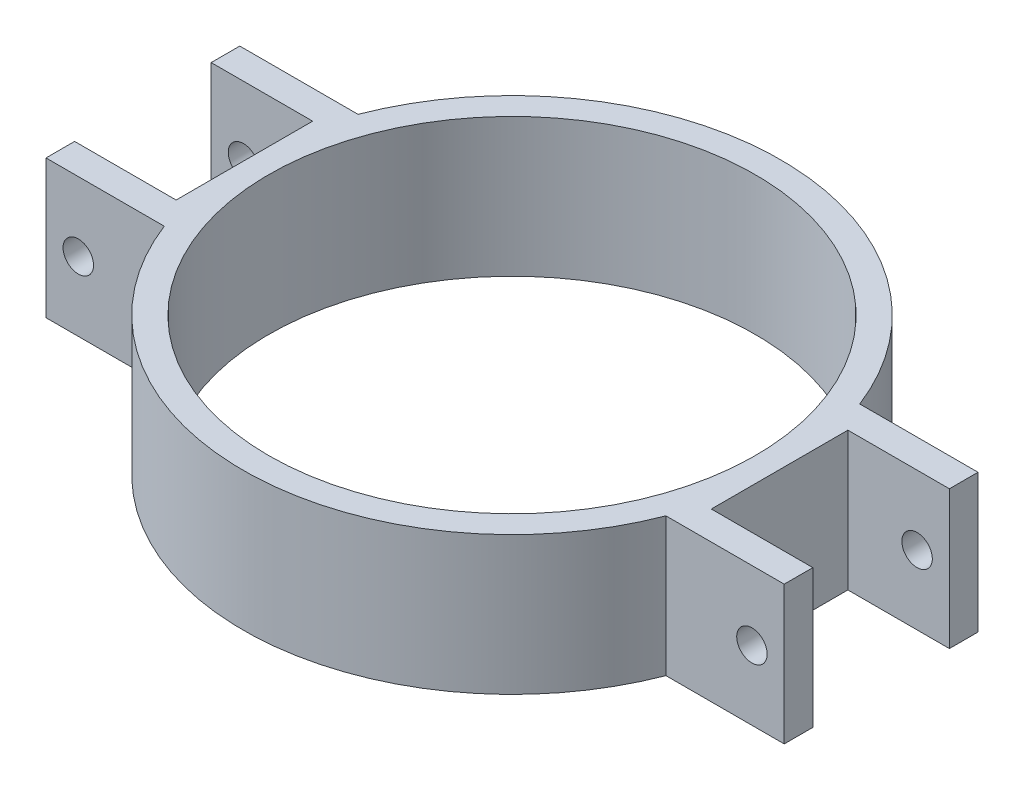
ISO-10303-21;
HEADER;
FILE_DESCRIPTION(('STEP AP214'),'2;1');
FILE_NAME('part.step','',(''),(''),'','','');
FILE_SCHEMA(('AUTOMOTIVE_DESIGN { 1 0 10303 214 1 1 1 1 }'));
ENDSEC;
DATA;
#1=APPLICATION_CONTEXT('core data for automotive mechanical design processes');
#2=APPLICATION_PROTOCOL_DEFINITION('international standard','automotive_design',2000,#1);
#3=PRODUCT_CONTEXT('',#1,'mechanical');
#4=PRODUCT('Part','Part','',(#3));
#5=PRODUCT_RELATED_PRODUCT_CATEGORY('part','',(#4));
#6=PRODUCT_DEFINITION_FORMATION('','',#4);
#7=PRODUCT_DEFINITION_CONTEXT('part definition',#1,'design');
#8=PRODUCT_DEFINITION('design','',#6,#7);
#9=PRODUCT_DEFINITION_SHAPE('','',#8);
#10=(LENGTH_UNIT() NAMED_UNIT(*) SI_UNIT(.MILLI.,.METRE.));
#11=(NAMED_UNIT(*) PLANE_ANGLE_UNIT() SI_UNIT($,.RADIAN.));
#12=(NAMED_UNIT(*) SI_UNIT($,.STERADIAN.) SOLID_ANGLE_UNIT());
#13=UNCERTAINTY_MEASURE_WITH_UNIT(LENGTH_MEASURE(1.E-05),#10,'distance_accuracy_value','');
#14=(GEOMETRIC_REPRESENTATION_CONTEXT(3) GLOBAL_UNCERTAINTY_ASSIGNED_CONTEXT((#13)) GLOBAL_UNIT_ASSIGNED_CONTEXT((#10,
#11,#12)) REPRESENTATION_CONTEXT('',''));
#15=CARTESIAN_POINT('',(0.,0.,0.));
#16=DIRECTION('',(0.,0.,1.));
#17=DIRECTION('',(1.,0.,0.));
#18=AXIS2_PLACEMENT_3D('',#15,#16,#17);
#19=CARTESIAN_POINT('',(0.,15.,0.));
#20=DIRECTION('',(0.,1.,0.));
#21=DIRECTION('',(0.,0.,1.));
#22=AXIS2_PLACEMENT_3D('',#19,#20,#21);
#23=PLANE('',#22);
#24=DIRECTION('',(0.,0.,1.));
#25=VECTOR('',#24,1.);
#26=CARTESIAN_POINT('',(-40.,15.,-7.4));
#27=LINE('',#26,#25);
#28=CARTESIAN_POINT('',(-40.,15.,-10.5));
#29=VERTEX_POINT('',#28);
#30=CARTESIAN_POINT('',(-40.,15.,-7.4));
#31=VERTEX_POINT('',#30);
#32=EDGE_CURVE('E211',#29,#31,#27,.T.);
#33=ORIENTED_EDGE('',*,*,#32,.T.);
#34=DIRECTION('',(1.,0.,0.));
#35=VECTOR('',#34,1.);
#36=CARTESIAN_POINT('',(-40.,15.,-7.4));
#37=LINE('',#36,#35);
#38=CARTESIAN_POINT('',(-29.,15.,-7.4));
#39=VERTEX_POINT('',#38);
#40=EDGE_CURVE('E119',#31,#39,#37,.T.);
#41=ORIENTED_EDGE('',*,*,#40,.T.);
#42=DIRECTION('',(0.,0.,1.));
#43=VECTOR('',#42,1.);
#44=CARTESIAN_POINT('',(-29.,15.,-7.4));
#45=LINE('',#44,#43);
#46=CARTESIAN_POINT('',(-29.,15.,7.4));
#47=VERTEX_POINT('',#46);
#48=EDGE_CURVE('E250',#39,#47,#45,.T.);
#49=ORIENTED_EDGE('',*,*,#48,.T.);
#50=DIRECTION('',(-1.,0.,0.));
#51=VECTOR('',#50,1.);
#52=CARTESIAN_POINT('',(-29.,15.,7.4));
#53=LINE('',#52,#51);
#54=CARTESIAN_POINT('',(-40.,15.,7.4));
#55=VERTEX_POINT('',#54);
#56=EDGE_CURVE('E269',#47,#55,#53,.T.);
#57=ORIENTED_EDGE('',*,*,#56,.T.);
#58=DIRECTION('',(0.,0.,1.));
#59=VECTOR('',#58,1.);
#60=CARTESIAN_POINT('',(-40.,15.,10.5));
#61=LINE('',#60,#59);
#62=CARTESIAN_POINT('',(-40.,15.,10.5));
#63=VERTEX_POINT('',#62);
#64=EDGE_CURVE('E266',#55,#63,#61,.T.);
#65=ORIENTED_EDGE('',*,*,#64,.T.);
#66=DIRECTION('',(1.,0.,0.));
#67=VECTOR('',#66,1.);
#68=CARTESIAN_POINT('',(-27.1825237974696,15.,10.5));
#69=LINE('',#68,#67);
#70=CARTESIAN_POINT('',(-27.1825237974696,15.,10.5));
#71=VERTEX_POINT('',#70);
#72=EDGE_CURVE('E268',#63,#71,#69,.T.);
#73=ORIENTED_EDGE('',*,*,#72,.T.);
#74=CARTESIAN_POINT('',(0.,15.,0.));
#75=DIRECTION('',(0.,1.,0.));
#76=DIRECTION('',(0.,0.,1.));
#77=AXIS2_PLACEMENT_3D('',#74,#75,#76);
#78=CIRCLE('',#77,29.14);
#79=CARTESIAN_POINT('',(27.1825237974696,15.,10.5));
#80=VERTEX_POINT('',#79);
#81=EDGE_CURVE('E271',#71,#80,#78,.T.);
#82=ORIENTED_EDGE('',*,*,#81,.T.);
#83=DIRECTION('',(1.,0.,0.));
#84=VECTOR('',#83,1.);
#85=CARTESIAN_POINT('',(40.,15.,10.5));
#86=LINE('',#85,#84);
#87=CARTESIAN_POINT('',(40.,15.,10.5));
#88=VERTEX_POINT('',#87);
#89=EDGE_CURVE('E277',#80,#88,#86,.T.);
#90=ORIENTED_EDGE('',*,*,#89,.T.);
#91=DIRECTION('',(0.,0.,-1.));
#92=VECTOR('',#91,1.);
#93=CARTESIAN_POINT('',(40.,15.,7.4));
#94=LINE('',#93,#92);
#95=CARTESIAN_POINT('',(40.,15.,7.4));
#96=VERTEX_POINT('',#95);
#97=EDGE_CURVE('E279',#88,#96,#94,.T.);
#98=ORIENTED_EDGE('',*,*,#97,.T.);
#99=DIRECTION('',(-1.,0.,0.));
#100=VECTOR('',#99,1.);
#101=CARTESIAN_POINT('',(29.,15.,7.4));
#102=LINE('',#101,#100);
#103=CARTESIAN_POINT('',(29.,15.,7.4));
#104=VERTEX_POINT('',#103);
#105=EDGE_CURVE('E281',#96,#104,#102,.T.);
#106=ORIENTED_EDGE('',*,*,#105,.T.);
#107=DIRECTION('',(0.,0.,-1.));
#108=VECTOR('',#107,1.);
#109=CARTESIAN_POINT('',(29.,15.,-7.4));
#110=LINE('',#109,#108);
#111=CARTESIAN_POINT('',(29.,15.,-7.4));
#112=VERTEX_POINT('',#111);
#113=EDGE_CURVE('E283',#104,#112,#110,.T.);
#114=ORIENTED_EDGE('',*,*,#113,.T.);
#115=DIRECTION('',(1.,0.,0.));
#116=VECTOR('',#115,1.);
#117=CARTESIAN_POINT('',(40.,15.,-7.4));
#118=LINE('',#117,#116);
#119=CARTESIAN_POINT('',(40.,15.,-7.4));
#120=VERTEX_POINT('',#119);
#121=EDGE_CURVE('E285',#112,#120,#118,.T.);
#122=ORIENTED_EDGE('',*,*,#121,.T.);
#123=DIRECTION('',(0.,0.,-1.));
#124=VECTOR('',#123,1.);
#125=CARTESIAN_POINT('',(40.,15.,-10.5));
#126=LINE('',#125,#124);
#127=CARTESIAN_POINT('',(40.,15.,-10.5));
#128=VERTEX_POINT('',#127);
#129=EDGE_CURVE('E162',#120,#128,#126,.T.);
#130=ORIENTED_EDGE('',*,*,#129,.T.);
#131=DIRECTION('',(-1.,0.,0.));
#132=VECTOR('',#131,1.);
#133=CARTESIAN_POINT('',(27.1825237974696,15.,-10.5));
#134=LINE('',#133,#132);
#135=CARTESIAN_POINT('',(27.1825237974696,15.,-10.5));
#136=VERTEX_POINT('',#135);
#137=EDGE_CURVE('E156',#128,#136,#134,.T.);
#138=ORIENTED_EDGE('',*,*,#137,.T.);
#139=CARTESIAN_POINT('',(0.,15.,0.));
#140=DIRECTION('',(0.,1.,0.));
#141=DIRECTION('',(0.,0.,1.));
#142=AXIS2_PLACEMENT_3D('',#139,#140,#141);
#143=CIRCLE('',#142,29.14);
#144=CARTESIAN_POINT('',(-27.1825237974696,15.,-10.5));
#145=VERTEX_POINT('',#144);
#146=EDGE_CURVE('E160',#136,#145,#143,.T.);
#147=ORIENTED_EDGE('',*,*,#146,.T.);
#148=DIRECTION('',(-1.,0.,0.));
#149=VECTOR('',#148,1.);
#150=CARTESIAN_POINT('',(-27.1825237974696,15.,-10.5));
#151=LINE('',#150,#149);
#152=EDGE_CURVE('E52',#145,#29,#151,.T.);
#153=ORIENTED_EDGE('',*,*,#152,.T.);
#154=EDGE_LOOP('',(#33,#41,#49,#57,#65,#73,#82,#90,#98,#106,#114,#122,#130,#138,#147,#153));
#155=FACE_BOUND('',#154,.T.);
#156=CARTESIAN_POINT('',(0.,15.,0.));
#157=DIRECTION('',(0.,1.,0.));
#158=DIRECTION('',(0.,0.,1.));
#159=AXIS2_PLACEMENT_3D('',#156,#157,#158);
#160=CIRCLE('',#159,26.37);
#161=CARTESIAN_POINT('',(0.,15.,26.37));
#162=VERTEX_POINT('',#161);
#163=EDGE_CURVE('E184',#162,#162,#160,.T.);
#164=ORIENTED_EDGE('',*,*,#163,.F.);
#165=EDGE_LOOP('',(#164));
#166=FACE_BOUND('',#165,.T.);
#167=ADVANCED_FACE('F35',(#155,#166),#23,.T.);
#168=CARTESIAN_POINT('',(0.,0.,0.));
#169=DIRECTION('',(0.,1.,0.));
#170=DIRECTION('',(0.,0.,1.));
#171=AXIS2_PLACEMENT_3D('',#168,#169,#170);
#172=PLANE('',#171);
#173=DIRECTION('',(0.,0.,1.));
#174=VECTOR('',#173,1.);
#175=CARTESIAN_POINT('',(-40.,0.,-7.4));
#176=LINE('',#175,#174);
#177=CARTESIAN_POINT('',(-40.,0.,-10.5));
#178=VERTEX_POINT('',#177);
#179=CARTESIAN_POINT('',(-40.,0.,-7.4));
#180=VERTEX_POINT('',#179);
#181=EDGE_CURVE('E180',#178,#180,#176,.T.);
#182=ORIENTED_EDGE('',*,*,#181,.F.);
#183=DIRECTION('',(-1.,0.,0.));
#184=VECTOR('',#183,1.);
#185=CARTESIAN_POINT('',(-27.1825237974696,0.,-10.5));
#186=LINE('',#185,#184);
#187=CARTESIAN_POINT('',(-27.1825237974696,0.,-10.5));
#188=VERTEX_POINT('',#187);
#189=EDGE_CURVE('E111',#188,#178,#186,.T.);
#190=ORIENTED_EDGE('',*,*,#189,.F.);
#191=CARTESIAN_POINT('',(0.,0.,0.));
#192=DIRECTION('',(0.,1.,0.));
#193=DIRECTION('',(0.,0.,1.));
#194=AXIS2_PLACEMENT_3D('',#191,#192,#193);
#195=CIRCLE('',#194,29.14);
#196=CARTESIAN_POINT('',(27.1825237974696,0.,-10.5));
#197=VERTEX_POINT('',#196);
#198=EDGE_CURVE('E105',#197,#188,#195,.T.);
#199=ORIENTED_EDGE('',*,*,#198,.F.);
#200=DIRECTION('',(-1.,0.,0.));
#201=VECTOR('',#200,1.);
#202=CARTESIAN_POINT('',(27.1825237974696,0.,-10.5));
#203=LINE('',#202,#201);
#204=CARTESIAN_POINT('',(40.,0.,-10.5));
#205=VERTEX_POINT('',#204);
#206=EDGE_CURVE('E170',#205,#197,#203,.T.);
#207=ORIENTED_EDGE('',*,*,#206,.F.);
#208=DIRECTION('',(0.,0.,-1.));
#209=VECTOR('',#208,1.);
#210=CARTESIAN_POINT('',(40.,0.,-10.5));
#211=LINE('',#210,#209);
#212=CARTESIAN_POINT('',(40.,0.,-7.4));
#213=VERTEX_POINT('',#212);
#214=EDGE_CURVE('E206',#213,#205,#211,.T.);
#215=ORIENTED_EDGE('',*,*,#214,.F.);
#216=DIRECTION('',(1.,0.,0.));
#217=VECTOR('',#216,1.);
#218=CARTESIAN_POINT('',(40.,0.,-7.4));
#219=LINE('',#218,#217);
#220=CARTESIAN_POINT('',(29.,0.,-7.4));
#221=VERTEX_POINT('',#220);
#222=EDGE_CURVE('E204',#221,#213,#219,.T.);
#223=ORIENTED_EDGE('',*,*,#222,.F.);
#224=DIRECTION('',(0.,0.,-1.));
#225=VECTOR('',#224,1.);
#226=CARTESIAN_POINT('',(29.,0.,-7.4));
#227=LINE('',#226,#225);
#228=CARTESIAN_POINT('',(29.,0.,7.4));
#229=VERTEX_POINT('',#228);
#230=EDGE_CURVE('E202',#229,#221,#227,.T.);
#231=ORIENTED_EDGE('',*,*,#230,.F.);
#232=DIRECTION('',(-1.,0.,0.));
#233=VECTOR('',#232,1.);
#234=CARTESIAN_POINT('',(29.,0.,7.4));
#235=LINE('',#234,#233);
#236=CARTESIAN_POINT('',(40.,0.,7.4));
#237=VERTEX_POINT('',#236);
#238=EDGE_CURVE('E200',#237,#229,#235,.T.);
#239=ORIENTED_EDGE('',*,*,#238,.F.);
#240=DIRECTION('',(0.,0.,-1.));
#241=VECTOR('',#240,1.);
#242=CARTESIAN_POINT('',(40.,0.,7.4));
#243=LINE('',#242,#241);
#244=CARTESIAN_POINT('',(40.,0.,10.5));
#245=VERTEX_POINT('',#244);
#246=EDGE_CURVE('E198',#245,#237,#243,.T.);
#247=ORIENTED_EDGE('',*,*,#246,.F.);
#248=DIRECTION('',(1.,0.,0.));
#249=VECTOR('',#248,1.);
#250=CARTESIAN_POINT('',(40.,0.,10.5));
#251=LINE('',#250,#249);
#252=CARTESIAN_POINT('',(27.1825237974696,0.,10.5));
#253=VERTEX_POINT('',#252);
#254=EDGE_CURVE('E196',#253,#245,#251,.T.);
#255=ORIENTED_EDGE('',*,*,#254,.F.);
#256=CARTESIAN_POINT('',(0.,0.,0.));
#257=DIRECTION('',(0.,1.,0.));
#258=DIRECTION('',(0.,0.,1.));
#259=AXIS2_PLACEMENT_3D('',#256,#257,#258);
#260=CIRCLE('',#259,29.14);
#261=CARTESIAN_POINT('',(-27.1825237974696,0.,10.5));
#262=VERTEX_POINT('',#261);
#263=EDGE_CURVE('E194',#262,#253,#260,.T.);
#264=ORIENTED_EDGE('',*,*,#263,.F.);
#265=DIRECTION('',(1.,0.,0.));
#266=VECTOR('',#265,1.);
#267=CARTESIAN_POINT('',(-27.1825237974696,0.,10.5));
#268=LINE('',#267,#266);
#269=CARTESIAN_POINT('',(-40.,0.,10.5));
#270=VERTEX_POINT('',#269);
#271=EDGE_CURVE('E192',#270,#262,#268,.T.);
#272=ORIENTED_EDGE('',*,*,#271,.F.);
#273=DIRECTION('',(0.,0.,1.));
#274=VECTOR('',#273,1.);
#275=CARTESIAN_POINT('',(-40.,0.,10.5));
#276=LINE('',#275,#274);
#277=CARTESIAN_POINT('',(-40.,0.,7.4));
#278=VERTEX_POINT('',#277);
#279=EDGE_CURVE('E190',#278,#270,#276,.T.);
#280=ORIENTED_EDGE('',*,*,#279,.F.);
#281=DIRECTION('',(-1.,0.,0.));
#282=VECTOR('',#281,1.);
#283=CARTESIAN_POINT('',(-29.,0.,7.4));
#284=LINE('',#283,#282);
#285=CARTESIAN_POINT('',(-29.,0.,7.4));
#286=VERTEX_POINT('',#285);
#287=EDGE_CURVE('E188',#286,#278,#284,.T.);
#288=ORIENTED_EDGE('',*,*,#287,.F.);
#289=DIRECTION('',(0.,0.,1.));
#290=VECTOR('',#289,1.);
#291=CARTESIAN_POINT('',(-29.,0.,-7.4));
#292=LINE('',#291,#290);
#293=CARTESIAN_POINT('',(-29.,0.,-7.4));
#294=VERTEX_POINT('',#293);
#295=EDGE_CURVE('E186',#294,#286,#292,.T.);
#296=ORIENTED_EDGE('',*,*,#295,.F.);
#297=DIRECTION('',(1.,0.,0.));
#298=VECTOR('',#297,1.);
#299=CARTESIAN_POINT('',(-40.,0.,-7.4));
#300=LINE('',#299,#298);
#301=EDGE_CURVE('E183',#180,#294,#300,.T.);
#302=ORIENTED_EDGE('',*,*,#301,.F.);
#303=EDGE_LOOP('',(#182,#190,#199,#207,#215,#223,#231,#239,#247,#255,#264,#272,#280,#288,#296,#302));
#304=FACE_BOUND('',#303,.T.);
#305=CARTESIAN_POINT('',(0.,0.,0.));
#306=DIRECTION('',(0.,1.,0.));
#307=DIRECTION('',(0.,0.,1.));
#308=AXIS2_PLACEMENT_3D('',#305,#306,#307);
#309=CIRCLE('',#308,26.37);
#310=CARTESIAN_POINT('',(0.,0.,26.37));
#311=VERTEX_POINT('',#310);
#312=EDGE_CURVE('E357',#311,#311,#309,.T.);
#313=ORIENTED_EDGE('',*,*,#312,.T.);
#314=EDGE_LOOP('',(#313));
#315=FACE_BOUND('',#314,.T.);
#316=ADVANCED_FACE('F254',(#304,#315),#172,.F.);
#317=CARTESIAN_POINT('',(-40.,15.,-7.4));
#318=DIRECTION('',(1.,0.,0.));
#319=DIRECTION('',(0.,0.,-1.));
#320=AXIS2_PLACEMENT_3D('',#317,#318,#319);
#321=PLANE('',#320);
#322=ORIENTED_EDGE('',*,*,#181,.T.);
#323=DIRECTION('',(0.,-1.,0.));
#324=VECTOR('',#323,1.);
#325=CARTESIAN_POINT('',(-40.,15.,-7.4));
#326=LINE('',#325,#324);
#327=EDGE_CURVE('E11',#31,#180,#326,.T.);
#328=ORIENTED_EDGE('',*,*,#327,.F.);
#329=ORIENTED_EDGE('',*,*,#32,.F.);
#330=DIRECTION('',(0.,-1.,0.));
#331=VECTOR('',#330,1.);
#332=CARTESIAN_POINT('',(-40.,15.,-10.5));
#333=LINE('',#332,#331);
#334=EDGE_CURVE('E176',#29,#178,#333,.T.);
#335=ORIENTED_EDGE('',*,*,#334,.T.);
#336=EDGE_LOOP('',(#322,#328,#329,#335));
#337=FACE_BOUND('',#336,.T.);
#338=ADVANCED_FACE('F37',(#337),#321,.F.);
#339=CARTESIAN_POINT('',(-40.,15.,-7.4));
#340=DIRECTION('',(0.,0.,-1.));
#341=DIRECTION('',(-1.,0.,0.));
#342=AXIS2_PLACEMENT_3D('',#339,#340,#341);
#343=PLANE('',#342);
#344=CARTESIAN_POINT('',(-36.5,7.5,-7.4));
#345=DIRECTION('',(0.,0.,-1.));
#346=DIRECTION('',(-1.,0.,0.));
#347=AXIS2_PLACEMENT_3D('',#344,#345,#346);
#348=CIRCLE('',#347,1.65);
#349=CARTESIAN_POINT('',(-38.15,7.5,-7.4));
#350=VERTEX_POINT('',#349);
#351=EDGE_CURVE('E354',#350,#350,#348,.T.);
#352=ORIENTED_EDGE('',*,*,#351,.T.);
#353=EDGE_LOOP('',(#352));
#354=FACE_BOUND('',#353,.T.);
#355=ORIENTED_EDGE('',*,*,#301,.T.);
#356=DIRECTION('',(0.,-1.,0.));
#357=VECTOR('',#356,1.);
#358=CARTESIAN_POINT('',(-29.,15.,-7.4));
#359=LINE('',#358,#357);
#360=EDGE_CURVE('E44',#39,#294,#359,.T.);
#361=ORIENTED_EDGE('',*,*,#360,.F.);
#362=ORIENTED_EDGE('',*,*,#40,.F.);
#363=ORIENTED_EDGE('',*,*,#327,.T.);
#364=EDGE_LOOP('',(#355,#361,#362,#363));
#365=FACE_BOUND('',#364,.T.);
#366=ADVANCED_FACE('F368',(#354,#365),#343,.F.);
#367=CARTESIAN_POINT('',(-29.,15.,-7.4));
#368=DIRECTION('',(1.,0.,0.));
#369=DIRECTION('',(0.,0.,-1.));
#370=AXIS2_PLACEMENT_3D('',#367,#368,#369);
#371=PLANE('',#370);
#372=ORIENTED_EDGE('',*,*,#295,.T.);
#373=DIRECTION('',(0.,-1.,0.));
#374=VECTOR('',#373,1.);
#375=CARTESIAN_POINT('',(-29.,15.,7.4));
#376=LINE('',#375,#374);
#377=EDGE_CURVE('E242',#47,#286,#376,.T.);
#378=ORIENTED_EDGE('',*,*,#377,.F.);
#379=ORIENTED_EDGE('',*,*,#48,.F.);
#380=ORIENTED_EDGE('',*,*,#360,.T.);
#381=EDGE_LOOP('',(#372,#378,#379,#380));
#382=FACE_BOUND('',#381,.T.);
#383=ADVANCED_FACE('F248',(#382),#371,.F.);
#384=CARTESIAN_POINT('',(-29.,15.,7.4));
#385=DIRECTION('',(0.,0.,1.));
#386=DIRECTION('',(1.,0.,0.));
#387=AXIS2_PLACEMENT_3D('',#384,#385,#386);
#388=PLANE('',#387);
#389=CARTESIAN_POINT('',(-36.5,7.5,7.4));
#390=DIRECTION('',(0.,0.,1.));
#391=DIRECTION('',(1.,0.,0.));
#392=AXIS2_PLACEMENT_3D('',#389,#390,#391);
#393=CIRCLE('',#392,1.65);
#394=CARTESIAN_POINT('',(-34.85,7.5,7.4));
#395=VERTEX_POINT('',#394);
#396=EDGE_CURVE('E351',#395,#395,#393,.T.);
#397=ORIENTED_EDGE('',*,*,#396,.T.);
#398=EDGE_LOOP('',(#397));
#399=FACE_BOUND('',#398,.T.);
#400=ORIENTED_EDGE('',*,*,#287,.T.);
#401=DIRECTION('',(0.,-1.,0.));
#402=VECTOR('',#401,1.);
#403=CARTESIAN_POINT('',(-40.,15.,7.4));
#404=LINE('',#403,#402);
#405=EDGE_CURVE('E239',#55,#278,#404,.T.);
#406=ORIENTED_EDGE('',*,*,#405,.F.);
#407=ORIENTED_EDGE('',*,*,#56,.F.);
#408=ORIENTED_EDGE('',*,*,#377,.T.);
#409=EDGE_LOOP('',(#400,#406,#407,#408));
#410=FACE_BOUND('',#409,.T.);
#411=ADVANCED_FACE('F260',(#399,#410),#388,.F.);
#412=CARTESIAN_POINT('',(-40.,15.,10.5));
#413=DIRECTION('',(1.,0.,0.));
#414=DIRECTION('',(0.,0.,-1.));
#415=AXIS2_PLACEMENT_3D('',#412,#413,#414);
#416=PLANE('',#415);
#417=ORIENTED_EDGE('',*,*,#279,.T.);
#418=DIRECTION('',(0.,-1.,0.));
#419=VECTOR('',#418,1.);
#420=CARTESIAN_POINT('',(-40.,15.,10.5));
#421=LINE('',#420,#419);
#422=EDGE_CURVE('E236',#63,#270,#421,.T.);
#423=ORIENTED_EDGE('',*,*,#422,.F.);
#424=ORIENTED_EDGE('',*,*,#64,.F.);
#425=ORIENTED_EDGE('',*,*,#405,.T.);
#426=EDGE_LOOP('',(#417,#423,#424,#425));
#427=FACE_BOUND('',#426,.T.);
#428=ADVANCED_FACE('F264',(#427),#416,.F.);
#429=CARTESIAN_POINT('',(-27.1825237974696,15.,10.5));
#430=DIRECTION('',(0.,0.,-1.));
#431=DIRECTION('',(-1.,0.,0.));
#432=AXIS2_PLACEMENT_3D('',#429,#430,#431);
#433=PLANE('',#432);
#434=CARTESIAN_POINT('',(-36.5,7.5,10.5));
#435=DIRECTION('',(0.,0.,-1.));
#436=DIRECTION('',(-1.,0.,0.));
#437=AXIS2_PLACEMENT_3D('',#434,#435,#436);
#438=CIRCLE('',#437,1.65);
#439=CARTESIAN_POINT('',(-38.15,7.5,10.5));
#440=VERTEX_POINT('',#439);
#441=EDGE_CURVE('E343',#440,#440,#438,.T.);
#442=ORIENTED_EDGE('',*,*,#441,.T.);
#443=EDGE_LOOP('',(#442));
#444=FACE_BOUND('',#443,.T.);
#445=ORIENTED_EDGE('',*,*,#271,.T.);
#446=DIRECTION('',(0.,-1.,0.));
#447=VECTOR('',#446,1.);
#448=CARTESIAN_POINT('',(-27.1825237974696,15.,10.5));
#449=LINE('',#448,#447);
#450=EDGE_CURVE('E233',#71,#262,#449,.T.);
#451=ORIENTED_EDGE('',*,*,#450,.F.);
#452=ORIENTED_EDGE('',*,*,#72,.F.);
#453=ORIENTED_EDGE('',*,*,#422,.T.);
#454=EDGE_LOOP('',(#445,#451,#452,#453));
#455=FACE_BOUND('',#454,.T.);
#456=ADVANCED_FACE('F382',(#444,#455),#433,.F.);
#457=CARTESIAN_POINT('',(0.,15.,0.));
#458=DIRECTION('',(0.,-1.,0.));
#459=DIRECTION('',(0.,0.,-1.));
#460=AXIS2_PLACEMENT_3D('',#457,#458,#459);
#461=CYLINDRICAL_SURFACE('',#460,29.14);
#462=ORIENTED_EDGE('',*,*,#263,.T.);
#463=DIRECTION('',(0.,-1.,0.));
#464=VECTOR('',#463,1.);
#465=CARTESIAN_POINT('',(27.1825237974696,15.,10.5));
#466=LINE('',#465,#464);
#467=EDGE_CURVE('E230',#80,#253,#466,.T.);
#468=ORIENTED_EDGE('',*,*,#467,.F.);
#469=ORIENTED_EDGE('',*,*,#81,.F.);
#470=ORIENTED_EDGE('',*,*,#450,.T.);
#471=EDGE_LOOP('',(#462,#468,#469,#470));
#472=FACE_BOUND('',#471,.T.);
#473=ADVANCED_FACE('F385',(#472),#461,.T.);
#474=CARTESIAN_POINT('',(40.,15.,10.5));
#475=DIRECTION('',(0.,0.,-1.));
#476=DIRECTION('',(-1.,0.,0.));
#477=AXIS2_PLACEMENT_3D('',#474,#475,#476);
#478=PLANE('',#477);
#479=CARTESIAN_POINT('',(36.5,7.5,10.5));
#480=DIRECTION('',(0.,0.,-1.));
#481=DIRECTION('',(-1.,0.,0.));
#482=AXIS2_PLACEMENT_3D('',#479,#480,#481);
#483=CIRCLE('',#482,1.65);
#484=CARTESIAN_POINT('',(34.85,7.5,10.5));
#485=VERTEX_POINT('',#484);
#486=EDGE_CURVE('E338',#485,#485,#483,.T.);
#487=ORIENTED_EDGE('',*,*,#486,.T.);
#488=EDGE_LOOP('',(#487));
#489=FACE_BOUND('',#488,.T.);
#490=ORIENTED_EDGE('',*,*,#254,.T.);
#491=DIRECTION('',(0.,-1.,0.));
#492=VECTOR('',#491,1.);
#493=CARTESIAN_POINT('',(40.,15.,10.5));
#494=LINE('',#493,#492);
#495=EDGE_CURVE('E227',#88,#245,#494,.T.);
#496=ORIENTED_EDGE('',*,*,#495,.F.);
#497=ORIENTED_EDGE('',*,*,#89,.F.);
#498=ORIENTED_EDGE('',*,*,#467,.T.);
#499=EDGE_LOOP('',(#490,#496,#497,#498));
#500=FACE_BOUND('',#499,.T.);
#501=ADVANCED_FACE('F389',(#489,#500),#478,.F.);
#502=CARTESIAN_POINT('',(40.,15.,7.4));
#503=DIRECTION('',(-1.,0.,0.));
#504=DIRECTION('',(0.,0.,1.));
#505=AXIS2_PLACEMENT_3D('',#502,#503,#504);
#506=PLANE('',#505);
#507=ORIENTED_EDGE('',*,*,#246,.T.);
#508=DIRECTION('',(0.,-1.,0.));
#509=VECTOR('',#508,1.);
#510=CARTESIAN_POINT('',(40.,15.,7.4));
#511=LINE('',#510,#509);
#512=EDGE_CURVE('E224',#96,#237,#511,.T.);
#513=ORIENTED_EDGE('',*,*,#512,.F.);
#514=ORIENTED_EDGE('',*,*,#97,.F.);
#515=ORIENTED_EDGE('',*,*,#495,.T.);
#516=EDGE_LOOP('',(#507,#513,#514,#515));
#517=FACE_BOUND('',#516,.T.);
#518=ADVANCED_FACE('F393',(#517),#506,.F.);
#519=CARTESIAN_POINT('',(29.,15.,7.4));
#520=DIRECTION('',(0.,0.,1.));
#521=DIRECTION('',(1.,0.,0.));
#522=AXIS2_PLACEMENT_3D('',#519,#520,#521);
#523=PLANE('',#522);
#524=CARTESIAN_POINT('',(36.5,7.5,7.4));
#525=DIRECTION('',(0.,0.,1.));
#526=DIRECTION('',(1.,0.,0.));
#527=AXIS2_PLACEMENT_3D('',#524,#525,#526);
#528=CIRCLE('',#527,1.65);
#529=CARTESIAN_POINT('',(38.15,7.5,7.4));
#530=VERTEX_POINT('',#529);
#531=EDGE_CURVE('E335',#530,#530,#528,.T.);
#532=ORIENTED_EDGE('',*,*,#531,.T.);
#533=EDGE_LOOP('',(#532));
#534=FACE_BOUND('',#533,.T.);
#535=ORIENTED_EDGE('',*,*,#238,.T.);
#536=DIRECTION('',(0.,-1.,0.));
#537=VECTOR('',#536,1.);
#538=CARTESIAN_POINT('',(29.,15.,7.4));
#539=LINE('',#538,#537);
#540=EDGE_CURVE('E221',#104,#229,#539,.T.);
#541=ORIENTED_EDGE('',*,*,#540,.F.);
#542=ORIENTED_EDGE('',*,*,#105,.F.);
#543=ORIENTED_EDGE('',*,*,#512,.T.);
#544=EDGE_LOOP('',(#535,#541,#542,#543));
#545=FACE_BOUND('',#544,.T.);
#546=ADVANCED_FACE('F396',(#534,#545),#523,.F.);
#547=CARTESIAN_POINT('',(29.,15.,-7.4));
#548=DIRECTION('',(-1.,0.,0.));
#549=DIRECTION('',(0.,0.,1.));
#550=AXIS2_PLACEMENT_3D('',#547,#548,#549);
#551=PLANE('',#550);
#552=ORIENTED_EDGE('',*,*,#230,.T.);
#553=DIRECTION('',(0.,-1.,0.));
#554=VECTOR('',#553,1.);
#555=CARTESIAN_POINT('',(29.,15.,-7.4));
#556=LINE('',#555,#554);
#557=EDGE_CURVE('E218',#112,#221,#556,.T.);
#558=ORIENTED_EDGE('',*,*,#557,.F.);
#559=ORIENTED_EDGE('',*,*,#113,.F.);
#560=ORIENTED_EDGE('',*,*,#540,.T.);
#561=EDGE_LOOP('',(#552,#558,#559,#560));
#562=FACE_BOUND('',#561,.T.);
#563=ADVANCED_FACE('F400',(#562),#551,.F.);
#564=CARTESIAN_POINT('',(40.,15.,-7.4));
#565=DIRECTION('',(0.,0.,-1.));
#566=DIRECTION('',(-1.,0.,0.));
#567=AXIS2_PLACEMENT_3D('',#564,#565,#566);
#568=PLANE('',#567);
#569=CARTESIAN_POINT('',(36.5,7.5,-7.4));
#570=DIRECTION('',(0.,0.,-1.));
#571=DIRECTION('',(-1.,0.,0.));
#572=AXIS2_PLACEMENT_3D('',#569,#570,#571);
#573=CIRCLE('',#572,1.65);
#574=CARTESIAN_POINT('',(34.85,7.5,-7.4));
#575=VERTEX_POINT('',#574);
#576=EDGE_CURVE('E345',#575,#575,#573,.T.);
#577=ORIENTED_EDGE('',*,*,#576,.T.);
#578=EDGE_LOOP('',(#577));
#579=FACE_BOUND('',#578,.T.);
#580=ORIENTED_EDGE('',*,*,#222,.T.);
#581=DIRECTION('',(0.,-1.,0.));
#582=VECTOR('',#581,1.);
#583=CARTESIAN_POINT('',(40.,15.,-7.4));
#584=LINE('',#583,#582);
#585=EDGE_CURVE('E215',#120,#213,#584,.T.);
#586=ORIENTED_EDGE('',*,*,#585,.F.);
#587=ORIENTED_EDGE('',*,*,#121,.F.);
#588=ORIENTED_EDGE('',*,*,#557,.T.);
#589=EDGE_LOOP('',(#580,#586,#587,#588));
#590=FACE_BOUND('',#589,.T.);
#591=ADVANCED_FACE('F291',(#579,#590),#568,.F.);
#592=CARTESIAN_POINT('',(40.,15.,-10.5));
#593=DIRECTION('',(-1.,0.,0.));
#594=DIRECTION('',(0.,0.,1.));
#595=AXIS2_PLACEMENT_3D('',#592,#593,#594);
#596=PLANE('',#595);
#597=ORIENTED_EDGE('',*,*,#214,.T.);
#598=DIRECTION('',(0.,-1.,0.));
#599=VECTOR('',#598,1.);
#600=CARTESIAN_POINT('',(40.,15.,-10.5));
#601=LINE('',#600,#599);
#602=EDGE_CURVE('E171',#128,#205,#601,.T.);
#603=ORIENTED_EDGE('',*,*,#602,.F.);
#604=ORIENTED_EDGE('',*,*,#129,.F.);
#605=ORIENTED_EDGE('',*,*,#585,.T.);
#606=EDGE_LOOP('',(#597,#603,#604,#605));
#607=FACE_BOUND('',#606,.T.);
#608=ADVANCED_FACE('F295',(#607),#596,.F.);
#609=CARTESIAN_POINT('',(27.1825237974696,15.,-10.5));
#610=DIRECTION('',(0.,0.,1.));
#611=DIRECTION('',(1.,0.,0.));
#612=AXIS2_PLACEMENT_3D('',#609,#610,#611);
#613=PLANE('',#612);
#614=CARTESIAN_POINT('',(36.5,7.5,-10.5));
#615=DIRECTION('',(0.,0.,-1.));
#616=DIRECTION('',(-1.,0.,0.));
#617=AXIS2_PLACEMENT_3D('',#614,#615,#616);
#618=CIRCLE('',#617,1.65);
#619=CARTESIAN_POINT('',(34.85,7.5,-10.5));
#620=VERTEX_POINT('',#619);
#621=EDGE_CURVE('E416',#620,#620,#618,.T.);
#622=ORIENTED_EDGE('',*,*,#621,.F.);
#623=EDGE_LOOP('',(#622));
#624=FACE_BOUND('',#623,.T.);
#625=ORIENTED_EDGE('',*,*,#206,.T.);
#626=DIRECTION('',(0.,-1.,0.));
#627=VECTOR('',#626,1.);
#628=CARTESIAN_POINT('',(27.1825237974696,15.,-10.5));
#629=LINE('',#628,#627);
#630=EDGE_CURVE('E167',#136,#197,#629,.T.);
#631=ORIENTED_EDGE('',*,*,#630,.F.);
#632=ORIENTED_EDGE('',*,*,#137,.F.);
#633=ORIENTED_EDGE('',*,*,#602,.T.);
#634=EDGE_LOOP('',(#625,#631,#632,#633));
#635=FACE_BOUND('',#634,.T.);
#636=ADVANCED_FACE('F168',(#624,#635),#613,.F.);
#637=CARTESIAN_POINT('',(0.,15.,0.));
#638=DIRECTION('',(0.,-1.,0.));
#639=DIRECTION('',(0.,0.,-1.));
#640=AXIS2_PLACEMENT_3D('',#637,#638,#639);
#641=CYLINDRICAL_SURFACE('',#640,29.14);
#642=ORIENTED_EDGE('',*,*,#198,.T.);
#643=DIRECTION('',(0.,-1.,0.));
#644=VECTOR('',#643,1.);
#645=CARTESIAN_POINT('',(-27.1825237974696,15.,-10.5));
#646=LINE('',#645,#644);
#647=EDGE_CURVE('E172',#145,#188,#646,.T.);
#648=ORIENTED_EDGE('',*,*,#647,.F.);
#649=ORIENTED_EDGE('',*,*,#146,.F.);
#650=ORIENTED_EDGE('',*,*,#630,.T.);
#651=EDGE_LOOP('',(#642,#648,#649,#650));
#652=FACE_BOUND('',#651,.T.);
#653=ADVANCED_FACE('F174',(#652),#641,.T.);
#654=CARTESIAN_POINT('',(-27.1825237974696,15.,-10.5));
#655=DIRECTION('',(0.,0.,1.));
#656=DIRECTION('',(1.,0.,0.));
#657=AXIS2_PLACEMENT_3D('',#654,#655,#656);
#658=PLANE('',#657);
#659=CARTESIAN_POINT('',(-36.5,7.5,-10.5));
#660=DIRECTION('',(0.,0.,-1.));
#661=DIRECTION('',(-1.,0.,0.));
#662=AXIS2_PLACEMENT_3D('',#659,#660,#661);
#663=CIRCLE('',#662,1.65);
#664=CARTESIAN_POINT('',(-38.15,7.5,-10.5));
#665=VERTEX_POINT('',#664);
#666=EDGE_CURVE('E340',#665,#665,#663,.T.);
#667=ORIENTED_EDGE('',*,*,#666,.F.);
#668=EDGE_LOOP('',(#667));
#669=FACE_BOUND('',#668,.T.);
#670=ORIENTED_EDGE('',*,*,#189,.T.);
#671=ORIENTED_EDGE('',*,*,#334,.F.);
#672=ORIENTED_EDGE('',*,*,#152,.F.);
#673=ORIENTED_EDGE('',*,*,#647,.T.);
#674=EDGE_LOOP('',(#670,#671,#672,#673));
#675=FACE_BOUND('',#674,.T.);
#676=ADVANCED_FACE('F299',(#669,#675),#658,.F.);
#677=CARTESIAN_POINT('',(0.,15.,0.));
#678=DIRECTION('',(0.,-1.,0.));
#679=DIRECTION('',(0.,0.,-1.));
#680=AXIS2_PLACEMENT_3D('',#677,#678,#679);
#681=CYLINDRICAL_SURFACE('',#680,26.37);
#682=ORIENTED_EDGE('',*,*,#163,.T.);
#683=EDGE_LOOP('',(#682));
#684=FACE_BOUND('',#683,.T.);
#685=ORIENTED_EDGE('',*,*,#312,.F.);
#686=EDGE_LOOP('',(#685));
#687=FACE_BOUND('',#686,.T.);
#688=ADVANCED_FACE('F301',(#684,#687),#681,.F.);
#689=CARTESIAN_POINT('',(-36.5,7.5,12.5));
#690=DIRECTION('',(0.,0.,-1.));
#691=DIRECTION('',(-1.,0.,0.));
#692=AXIS2_PLACEMENT_3D('',#689,#690,#691);
#693=CYLINDRICAL_SURFACE('',#692,1.65);
#694=ORIENTED_EDGE('',*,*,#666,.T.);
#695=EDGE_LOOP('',(#694));
#696=FACE_BOUND('',#695,.T.);
#697=ORIENTED_EDGE('',*,*,#351,.F.);
#698=EDGE_LOOP('',(#697));
#699=FACE_BOUND('',#698,.T.);
#700=ADVANCED_FACE('F308',(#696,#699),#693,.F.);
#701=ORIENTED_EDGE('',*,*,#441,.F.);
#702=EDGE_LOOP('',(#701));
#703=FACE_BOUND('',#702,.T.);
#704=ORIENTED_EDGE('',*,*,#396,.F.);
#705=EDGE_LOOP('',(#704));
#706=FACE_BOUND('',#705,.T.);
#707=ADVANCED_FACE('F322',(#703,#706),#693,.F.);
#708=CARTESIAN_POINT('',(36.5,7.5,12.5));
#709=DIRECTION('',(0.,0.,-1.));
#710=DIRECTION('',(-1.,0.,0.));
#711=AXIS2_PLACEMENT_3D('',#708,#709,#710);
#712=CYLINDRICAL_SURFACE('',#711,1.65);
#713=ORIENTED_EDGE('',*,*,#621,.T.);
#714=EDGE_LOOP('',(#713));
#715=FACE_BOUND('',#714,.T.);
#716=ORIENTED_EDGE('',*,*,#576,.F.);
#717=EDGE_LOOP('',(#716));
#718=FACE_BOUND('',#717,.T.);
#719=ADVANCED_FACE('F326',(#715,#718),#712,.F.);
#720=ORIENTED_EDGE('',*,*,#531,.F.);
#721=EDGE_LOOP('',(#720));
#722=FACE_BOUND('',#721,.T.);
#723=ORIENTED_EDGE('',*,*,#486,.F.);
#724=EDGE_LOOP('',(#723));
#725=FACE_BOUND('',#724,.T.);
#726=ADVANCED_FACE('F324',(#722,#725),#712,.F.);
#727=CLOSED_SHELL('',(#167,#316,#338,#366,#383,#411,#428,#456,#473,#501,#518,#546,#563,#591,
#608,#636,#653,#676,#688,#700,#707,#719,#726));
#728=MANIFOLD_SOLID_BREP('B2',#727);
#729=ADVANCED_BREP_SHAPE_REPRESENTATION('',(#18,#728),#14);
#730=SHAPE_DEFINITION_REPRESENTATION(#9,#729);
ENDSEC;
END-ISO-10303-21;
